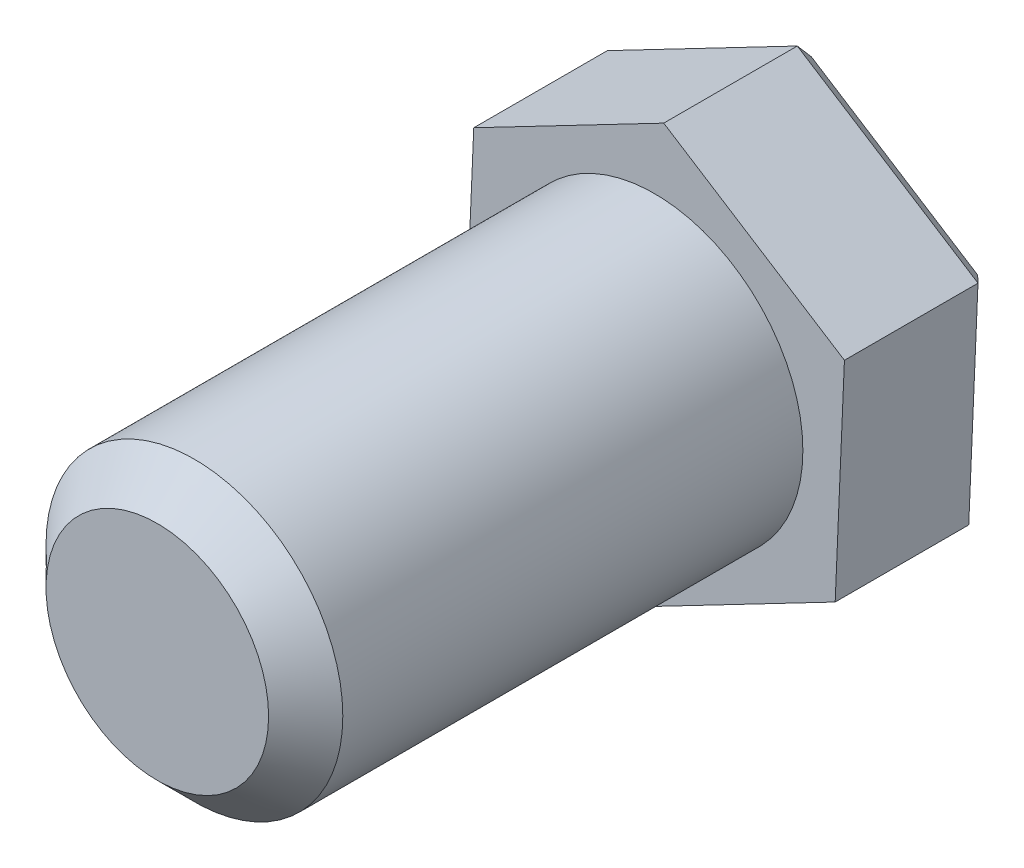
ISO-10303-21;
HEADER;
FILE_DESCRIPTION(('STEP AP214'),'2;1');
FILE_NAME('part.step','',(''),(''),'','','');
FILE_SCHEMA(('AUTOMOTIVE_DESIGN { 1 0 10303 214 1 1 1 1 }'));
ENDSEC;
DATA;
#1=APPLICATION_CONTEXT('core data for automotive mechanical design processes');
#2=APPLICATION_PROTOCOL_DEFINITION('international standard','automotive_design',2000,#1);
#3=PRODUCT_CONTEXT('',#1,'mechanical');
#4=PRODUCT('Part','Part','',(#3));
#5=PRODUCT_RELATED_PRODUCT_CATEGORY('part','',(#4));
#6=PRODUCT_DEFINITION_FORMATION('','',#4);
#7=PRODUCT_DEFINITION_CONTEXT('part definition',#1,'design');
#8=PRODUCT_DEFINITION('design','',#6,#7);
#9=PRODUCT_DEFINITION_SHAPE('','',#8);
#10=(LENGTH_UNIT() NAMED_UNIT(*) SI_UNIT(.MILLI.,.METRE.));
#11=(NAMED_UNIT(*) PLANE_ANGLE_UNIT() SI_UNIT($,.RADIAN.));
#12=(NAMED_UNIT(*) SI_UNIT($,.STERADIAN.) SOLID_ANGLE_UNIT());
#13=UNCERTAINTY_MEASURE_WITH_UNIT(LENGTH_MEASURE(1.E-05),#10,'distance_accuracy_value','');
#14=(GEOMETRIC_REPRESENTATION_CONTEXT(3) GLOBAL_UNCERTAINTY_ASSIGNED_CONTEXT((#13)) GLOBAL_UNIT_ASSIGNED_CONTEXT((#10,
#11,#12)) REPRESENTATION_CONTEXT('',''));
#15=CARTESIAN_POINT('',(0.,0.,0.));
#16=DIRECTION('',(0.,0.,1.));
#17=DIRECTION('',(1.,0.,0.));
#18=AXIS2_PLACEMENT_3D('',#15,#16,#17);
#19=CARTESIAN_POINT('',(0.,0.,6.7));
#20=DIRECTION('',(0.,0.,-1.));
#21=DIRECTION('',(-1.,0.,0.));
#22=AXIS2_PLACEMENT_3D('',#19,#20,#21);
#23=CYLINDRICAL_SURFACE('',#22,2.);
#24=CARTESIAN_POINT('',(0.,0.,6.2));
#25=DIRECTION('',(0.,0.,1.));
#26=DIRECTION('',(1.,0.,0.));
#27=AXIS2_PLACEMENT_3D('',#24,#25,#26);
#28=CIRCLE('',#27,2.);
#29=CARTESIAN_POINT('',(2.,0.,6.2));
#30=VERTEX_POINT('',#29);
#31=EDGE_CURVE('E184',#30,#30,#28,.F.);
#32=ORIENTED_EDGE('',*,*,#31,.T.);
#33=EDGE_LOOP('',(#32));
#34=FACE_BOUND('',#33,.T.);
#35=CARTESIAN_POINT('',(0.,0.,0.));
#36=DIRECTION('',(0.,0.,1.));
#37=DIRECTION('',(1.,0.,0.));
#38=AXIS2_PLACEMENT_3D('',#35,#36,#37);
#39=CIRCLE('',#38,2.);
#40=CARTESIAN_POINT('',(2.,0.,0.));
#41=VERTEX_POINT('',#40);
#42=EDGE_CURVE('E128',#41,#41,#39,.T.);
#43=ORIENTED_EDGE('',*,*,#42,.T.);
#44=EDGE_LOOP('',(#43));
#45=FACE_BOUND('',#44,.T.);
#46=ADVANCED_FACE('F47',(#34,#45),#23,.T.);
#47=CARTESIAN_POINT('',(0.,0.,6.7));
#48=DIRECTION('',(0.,0.,1.));
#49=DIRECTION('',(1.,0.,0.));
#50=AXIS2_PLACEMENT_3D('',#47,#48,#49);
#51=PLANE('',#50);
#52=CARTESIAN_POINT('',(0.,0.,6.7));
#53=DIRECTION('',(0.,0.,1.));
#54=DIRECTION('',(1.,0.,0.));
#55=AXIS2_PLACEMENT_3D('',#52,#53,#54);
#56=CIRCLE('',#55,1.5);
#57=CARTESIAN_POINT('',(1.5,0.,6.7));
#58=VERTEX_POINT('',#57);
#59=EDGE_CURVE('E180',#58,#58,#56,.T.);
#60=ORIENTED_EDGE('',*,*,#59,.T.);
#61=EDGE_LOOP('',(#60));
#62=FACE_BOUND('',#61,.T.);
#63=ADVANCED_FACE('F281',(#62),#51,.T.);
#64=CARTESIAN_POINT('',(0.,0.,6.7));
#65=DIRECTION('',(0.,0.,-1.));
#66=DIRECTION('',(-1.,0.,0.));
#67=AXIS2_PLACEMENT_3D('',#64,#65,#66);
#68=CONICAL_SURFACE('',#67,1.5,0.785398163397448);
#69=ORIENTED_EDGE('',*,*,#31,.F.);
#70=EDGE_LOOP('',(#69));
#71=FACE_BOUND('',#70,.T.);
#72=ORIENTED_EDGE('',*,*,#59,.F.);
#73=EDGE_LOOP('',(#72));
#74=FACE_BOUND('',#73,.T.);
#75=ADVANCED_FACE('F287',(#71,#74),#68,.T.);
#76=CARTESIAN_POINT('',(2.43525554792298,-1.55011733415367,-2.));
#77=DIRECTION('',(-0.462088466332157,0.886833834087759,0.));
#78=DIRECTION('',(-0.886833834087759,-0.462088466332157,0.));
#79=AXIS2_PLACEMENT_3D('',#76,#77,#78);
#80=PLANE('',#79);
#81=DIRECTION('',(0.,0.,1.));
#82=VECTOR('',#81,1.);
#83=CARTESIAN_POINT('',(-0.124813216262197,-2.88405183628513,-2.));
#84=LINE('',#83,#82);
#85=CARTESIAN_POINT('',(-0.124813216262197,-2.88405183628513,-1.8));
#86=VERTEX_POINT('',#85);
#87=CARTESIAN_POINT('',(-0.124813216262197,-2.88405183628513,0.));
#88=VERTEX_POINT('',#87);
#89=EDGE_CURVE('E119',#86,#88,#84,.T.);
#90=ORIENTED_EDGE('',*,*,#89,.F.);
#91=DIRECTION('',(0.886833834087759,0.462088466332157,0.));
#92=VECTOR('',#91,1.);
#93=CARTESIAN_POINT('',(2.43525554792298,-1.55011733415367,-1.8));
#94=LINE('',#93,#92);
#95=CARTESIAN_POINT('',(2.43525554792298,-1.55011733415367,-1.8));
#96=VERTEX_POINT('',#95);
#97=EDGE_CURVE('E11',#86,#96,#94,.T.);
#98=ORIENTED_EDGE('',*,*,#97,.T.);
#99=DIRECTION('',(0.,0.,1.));
#100=VECTOR('',#99,1.);
#101=CARTESIAN_POINT('',(2.43525554792298,-1.55011733415367,-2.));
#102=LINE('',#101,#100);
#103=CARTESIAN_POINT('',(2.43525554792298,-1.55011733415367,0.));
#104=VERTEX_POINT('',#103);
#105=EDGE_CURVE('E143',#96,#104,#102,.T.);
#106=ORIENTED_EDGE('',*,*,#105,.T.);
#107=DIRECTION('',(-0.886833834087759,-0.462088466332157,0.));
#108=VECTOR('',#107,1.);
#109=CARTESIAN_POINT('',(2.43525554792298,-1.55011733415367,0.));
#110=LINE('',#109,#108);
#111=EDGE_CURVE('E135',#104,#88,#110,.T.);
#112=ORIENTED_EDGE('',*,*,#111,.T.);
#113=EDGE_LOOP('',(#90,#98,#106,#112));
#114=FACE_BOUND('',#113,.T.);
#115=ADVANCED_FACE('F141',(#114),#80,.F.);
#116=CARTESIAN_POINT('',(-0.124813216262197,-2.88405183628513,-2.));
#117=DIRECTION('',(0.536976396089475,0.843597267683317,0.));
#118=DIRECTION('',(-0.843597267683317,0.536976396089475,0.));
#119=AXIS2_PLACEMENT_3D('',#116,#117,#118);
#120=PLANE('',#119);
#121=DIRECTION('',(0.,0.,1.));
#122=VECTOR('',#121,1.);
#123=CARTESIAN_POINT('',(-2.56006876418518,-1.33393450213146,-2.));
#124=LINE('',#123,#122);
#125=CARTESIAN_POINT('',(-2.56006876418518,-1.33393450213146,-1.8));
#126=VERTEX_POINT('',#125);
#127=CARTESIAN_POINT('',(-2.56006876418518,-1.33393450213146,0.));
#128=VERTEX_POINT('',#127);
#129=EDGE_CURVE('E129',#126,#128,#124,.T.);
#130=ORIENTED_EDGE('',*,*,#129,.F.);
#131=DIRECTION('',(0.843597267683317,-0.536976396089475,0.));
#132=VECTOR('',#131,1.);
#133=CARTESIAN_POINT('',(-0.124813216262197,-2.88405183628513,-1.8));
#134=LINE('',#133,#132);
#135=EDGE_CURVE('E58',#126,#86,#134,.T.);
#136=ORIENTED_EDGE('',*,*,#135,.T.);
#137=ORIENTED_EDGE('',*,*,#89,.T.);
#138=DIRECTION('',(-0.843597267683317,0.536976396089475,0.));
#139=VECTOR('',#138,1.);
#140=CARTESIAN_POINT('',(-0.124813216262197,-2.88405183628513,0.));
#141=LINE('',#140,#139);
#142=EDGE_CURVE('E122',#88,#128,#141,.T.);
#143=ORIENTED_EDGE('',*,*,#142,.T.);
#144=EDGE_LOOP('',(#130,#136,#137,#143));
#145=FACE_BOUND('',#144,.T.);
#146=ADVANCED_FACE('F121',(#145),#120,.F.);
#147=CARTESIAN_POINT('',(-2.56006876418518,-1.33393450213146,-2.));
#148=DIRECTION('',(0.999064862421632,-0.0432365664044416,0.));
#149=DIRECTION('',(0.0432365664044416,0.999064862421632,0.));
#150=AXIS2_PLACEMENT_3D('',#147,#148,#149);
#151=PLANE('',#150);
#152=DIRECTION('',(0.,0.,1.));
#153=VECTOR('',#152,1.);
#154=CARTESIAN_POINT('',(-2.43525554792298,1.55011733415367,-2.));
#155=LINE('',#154,#153);
#156=CARTESIAN_POINT('',(-2.43525554792298,1.55011733415367,-1.8));
#157=VERTEX_POINT('',#156);
#158=CARTESIAN_POINT('',(-2.43525554792298,1.55011733415367,0.));
#159=VERTEX_POINT('',#158);
#160=EDGE_CURVE('E172',#157,#159,#155,.T.);
#161=ORIENTED_EDGE('',*,*,#160,.F.);
#162=DIRECTION('',(-0.0432365664044416,-0.999064862421632,0.));
#163=VECTOR('',#162,1.);
#164=CARTESIAN_POINT('',(-2.56006876418518,-1.33393450213146,-1.8));
#165=LINE('',#164,#163);
#166=EDGE_CURVE('E73',#157,#126,#165,.T.);
#167=ORIENTED_EDGE('',*,*,#166,.T.);
#168=ORIENTED_EDGE('',*,*,#129,.T.);
#169=DIRECTION('',(0.0432365664044416,0.999064862421632,0.));
#170=VECTOR('',#169,1.);
#171=CARTESIAN_POINT('',(-2.56006876418518,-1.33393450213146,0.));
#172=LINE('',#171,#170);
#173=EDGE_CURVE('E138',#128,#159,#172,.T.);
#174=ORIENTED_EDGE('',*,*,#173,.T.);
#175=EDGE_LOOP('',(#161,#167,#168,#174));
#176=FACE_BOUND('',#175,.T.);
#177=ADVANCED_FACE('F411',(#176),#151,.F.);
#178=CARTESIAN_POINT('',(-2.43525554792298,1.55011733415367,-2.));
#179=DIRECTION('',(0.462088466332157,-0.886833834087759,0.));
#180=DIRECTION('',(0.886833834087759,0.462088466332157,0.));
#181=AXIS2_PLACEMENT_3D('',#178,#179,#180);
#182=PLANE('',#181);
#183=DIRECTION('',(0.,0.,1.));
#184=VECTOR('',#183,1.);
#185=CARTESIAN_POINT('',(0.124813216262197,2.88405183628513,-2.));
#186=LINE('',#185,#184);
#187=CARTESIAN_POINT('',(0.124813216262197,2.88405183628513,-1.8));
#188=VERTEX_POINT('',#187);
#189=CARTESIAN_POINT('',(0.124813216262197,2.88405183628513,0.));
#190=VERTEX_POINT('',#189);
#191=EDGE_CURVE('E169',#188,#190,#186,.T.);
#192=ORIENTED_EDGE('',*,*,#191,.F.);
#193=DIRECTION('',(-0.886833834087759,-0.462088466332157,0.));
#194=VECTOR('',#193,1.);
#195=CARTESIAN_POINT('',(-2.43525554792298,1.55011733415367,-1.8));
#196=LINE('',#195,#194);
#197=EDGE_CURVE('E214',#188,#157,#196,.T.);
#198=ORIENTED_EDGE('',*,*,#197,.T.);
#199=ORIENTED_EDGE('',*,*,#160,.T.);
#200=DIRECTION('',(0.886833834087759,0.462088466332157,0.));
#201=VECTOR('',#200,1.);
#202=CARTESIAN_POINT('',(-2.43525554792298,1.55011733415367,0.));
#203=LINE('',#202,#201);
#204=EDGE_CURVE('E153',#159,#190,#203,.T.);
#205=ORIENTED_EDGE('',*,*,#204,.T.);
#206=EDGE_LOOP('',(#192,#198,#199,#205));
#207=FACE_BOUND('',#206,.T.);
#208=ADVANCED_FACE('F269',(#207),#182,.F.);
#209=CARTESIAN_POINT('',(0.124813216262197,2.88405183628513,-2.));
#210=DIRECTION('',(-0.536976396089475,-0.843597267683318,0.));
#211=DIRECTION('',(0.843597267683318,-0.536976396089475,0.));
#212=AXIS2_PLACEMENT_3D('',#209,#210,#211);
#213=PLANE('',#212);
#214=DIRECTION('',(0.,0.,1.));
#215=VECTOR('',#214,1.);
#216=CARTESIAN_POINT('',(2.56006876418518,1.33393450213146,-2.));
#217=LINE('',#216,#215);
#218=CARTESIAN_POINT('',(2.56006876418518,1.33393450213146,-1.8));
#219=VERTEX_POINT('',#218);
#220=CARTESIAN_POINT('',(2.56006876418518,1.33393450213146,0.));
#221=VERTEX_POINT('',#220);
#222=EDGE_CURVE('E166',#219,#221,#217,.T.);
#223=ORIENTED_EDGE('',*,*,#222,.F.);
#224=DIRECTION('',(-0.843597267683318,0.536976396089475,0.));
#225=VECTOR('',#224,1.);
#226=CARTESIAN_POINT('',(0.124813216262197,2.88405183628513,-1.8));
#227=LINE('',#226,#225);
#228=EDGE_CURVE('E211',#219,#188,#227,.T.);
#229=ORIENTED_EDGE('',*,*,#228,.T.);
#230=ORIENTED_EDGE('',*,*,#191,.T.);
#231=DIRECTION('',(0.843597267683318,-0.536976396089475,0.));
#232=VECTOR('',#231,1.);
#233=CARTESIAN_POINT('',(0.124813216262197,2.88405183628513,0.));
#234=LINE('',#233,#232);
#235=EDGE_CURVE('E157',#190,#221,#234,.T.);
#236=ORIENTED_EDGE('',*,*,#235,.T.);
#237=EDGE_LOOP('',(#223,#229,#230,#236));
#238=FACE_BOUND('',#237,.T.);
#239=ADVANCED_FACE('F266',(#238),#213,.F.);
#240=CARTESIAN_POINT('',(2.56006876418518,1.33393450213146,-2.));
#241=DIRECTION('',(-0.999064862421632,0.0432365664044415,0.));
#242=DIRECTION('',(-0.0432365664044415,-0.999064862421632,0.));
#243=AXIS2_PLACEMENT_3D('',#240,#241,#242);
#244=PLANE('',#243);
#245=ORIENTED_EDGE('',*,*,#105,.F.);
#246=DIRECTION('',(0.0432365664044415,0.999064862421632,0.));
#247=VECTOR('',#246,1.);
#248=CARTESIAN_POINT('',(2.56006876418518,1.33393450213146,-1.8));
#249=LINE('',#248,#247);
#250=EDGE_CURVE('E207',#96,#219,#249,.T.);
#251=ORIENTED_EDGE('',*,*,#250,.T.);
#252=ORIENTED_EDGE('',*,*,#222,.T.);
#253=DIRECTION('',(-0.0432365664044415,-0.999064862421632,0.));
#254=VECTOR('',#253,1.);
#255=CARTESIAN_POINT('',(2.56006876418518,1.33393450213146,0.));
#256=LINE('',#255,#254);
#257=EDGE_CURVE('E161',#221,#104,#256,.T.);
#258=ORIENTED_EDGE('',*,*,#257,.T.);
#259=EDGE_LOOP('',(#245,#251,#252,#258));
#260=FACE_BOUND('',#259,.T.);
#261=ADVANCED_FACE('F255',(#260),#244,.F.);
#262=CARTESIAN_POINT('',(0.,0.,-2.));
#263=DIRECTION('',(0.,0.,-1.));
#264=DIRECTION('',(-1.,0.,0.));
#265=AXIS2_PLACEMENT_3D('',#262,#263,#264);
#266=PLANE('',#265);
#267=DIRECTION('',(0.843597267683318,-0.536976396089475,0.));
#268=VECTOR('',#267,1.);
#269=CARTESIAN_POINT('',(2.45267348496728,1.1652150485948,-2.));
#270=LINE('',#269,#268);
#271=CARTESIAN_POINT('',(0.11482815896122,2.65332768938232,-2.));
#272=VERTEX_POINT('',#271);
#273=CARTESIAN_POINT('',(2.35526326305036,1.22721974196094,-2.));
#274=VERTEX_POINT('',#273);
#275=EDGE_CURVE('E200',#272,#274,#270,.T.);
#276=ORIENTED_EDGE('',*,*,#275,.T.);
#277=DIRECTION('',(-0.0432365664044415,-0.999064862421632,0.));
#278=VECTOR('',#277,1.);
#279=CARTESIAN_POINT('',(2.23544257543865,-1.54147002087278,-2.));
#280=LINE('',#279,#278);
#281=CARTESIAN_POINT('',(2.24043510408914,-1.42610794742137,-2.));
#282=VERTEX_POINT('',#281);
#283=EDGE_CURVE('E203',#274,#282,#280,.T.);
#284=ORIENTED_EDGE('',*,*,#283,.T.);
#285=DIRECTION('',(-0.886833834087759,-0.462088466332157,0.));
#286=VECTOR('',#285,1.);
#287=CARTESIAN_POINT('',(-0.21723090952863,-2.70668506946757,-2.));
#288=LINE('',#287,#286);
#289=CARTESIAN_POINT('',(-0.114828158961222,-2.65332768938232,-2.));
#290=VERTEX_POINT('',#289);
#291=EDGE_CURVE('E188',#282,#290,#288,.T.);
#292=ORIENTED_EDGE('',*,*,#291,.T.);
#293=DIRECTION('',(-0.843597267683317,0.536976396089476,0.));
#294=VECTOR('',#293,1.);
#295=CARTESIAN_POINT('',(-2.45267348496728,-1.16521504859479,-2.));
#296=LINE('',#295,#294);
#297=CARTESIAN_POINT('',(-2.35526326305036,-1.22721974196094,-2.));
#298=VERTEX_POINT('',#297);
#299=EDGE_CURVE('E191',#290,#298,#296,.T.);
#300=ORIENTED_EDGE('',*,*,#299,.T.);
#301=DIRECTION('',(0.0432365664044416,0.999064862421632,0.));
#302=VECTOR('',#301,1.);
#303=CARTESIAN_POINT('',(-2.23544257543865,1.54147002087278,-2.));
#304=LINE('',#303,#302);
#305=CARTESIAN_POINT('',(-2.24043510408914,1.42610794742137,-2.));
#306=VERTEX_POINT('',#305);
#307=EDGE_CURVE('E194',#298,#306,#304,.T.);
#308=ORIENTED_EDGE('',*,*,#307,.T.);
#309=DIRECTION('',(0.886833834087759,0.462088466332157,0.));
#310=VECTOR('',#309,1.);
#311=CARTESIAN_POINT('',(0.217230909528629,2.70668506946758,-2.));
#312=LINE('',#311,#310);
#313=EDGE_CURVE('E197',#306,#272,#312,.T.);
#314=ORIENTED_EDGE('',*,*,#313,.T.);
#315=EDGE_LOOP('',(#276,#284,#292,#300,#308,#314));
#316=FACE_BOUND('',#315,.T.);
#317=ADVANCED_FACE('F245',(#316),#266,.T.);
#318=CARTESIAN_POINT('',(0.,0.,0.));
#319=DIRECTION('',(0.,0.,-1.));
#320=DIRECTION('',(-1.,0.,0.));
#321=AXIS2_PLACEMENT_3D('',#318,#319,#320);
#322=PLANE('',#321);
#323=ORIENTED_EDGE('',*,*,#42,.F.);
#324=EDGE_LOOP('',(#323));
#325=FACE_BOUND('',#324,.T.);
#326=ORIENTED_EDGE('',*,*,#111,.F.);
#327=ORIENTED_EDGE('',*,*,#257,.F.);
#328=ORIENTED_EDGE('',*,*,#235,.F.);
#329=ORIENTED_EDGE('',*,*,#204,.F.);
#330=ORIENTED_EDGE('',*,*,#173,.F.);
#331=ORIENTED_EDGE('',*,*,#142,.F.);
#332=EDGE_LOOP('',(#326,#327,#328,#329,#330,#331));
#333=FACE_BOUND('',#332,.T.);
#334=ADVANCED_FACE('F133',(#325,#333),#322,.F.);
#335=CARTESIAN_POINT('',(-2.29784918356975,0.0994441027302156,-2.));
#336=DIRECTION('',(-0.706445539063541,0.0305728692998031,-0.707106781186548));
#337=DIRECTION('',(-0.0432365664044416,-0.999064862421632,0.));
#338=AXIS2_PLACEMENT_3D('',#335,#336,#337);
#339=PLANE('',#338);
#340=DIRECTION('',(0.670383365495465,0.349306047321751,-0.654653670707977));
#341=VECTOR('',#340,1.);
#342=CARTESIAN_POINT('',(-2.01879708261459,-1.05190263596652,-2.32857142857143));
#343=LINE('',#342,#341);
#344=EDGE_CURVE('E149',#126,#298,#343,.T.);
#345=ORIENTED_EDGE('',*,*,#344,.F.);
#346=ORIENTED_EDGE('',*,*,#166,.F.);
#347=DIRECTION('',(0.637699593423899,-0.405916001132704,-0.654653670707977));
#348=VECTOR('',#347,1.);
#349=CARTESIAN_POINT('',(-1.92037294636212,1.22237824064689,-2.32857142857143));
#350=LINE('',#349,#348);
#351=EDGE_CURVE('E52',#306,#157,#350,.F.);
#352=ORIENTED_EDGE('',*,*,#351,.F.);
#353=ORIENTED_EDGE('',*,*,#307,.F.);
#354=EDGE_LOOP('',(#345,#346,#352,#353));
#355=FACE_BOUND('',#354,.T.);
#356=ADVANCED_FACE('F50',(#355),#339,.T.);
#357=CARTESIAN_POINT('',(-1.06280347256396,2.03971781840184,-2.));
#358=DIRECTION('',(-0.32674588805156,0.62708621786912,-0.707106781186547));
#359=DIRECTION('',(-0.886833834087759,-0.462088466332157,0.));
#360=AXIS2_PLACEMENT_3D('',#357,#358,#359);
#361=PLANE('',#360);
#362=ORIENTED_EDGE('',*,*,#351,.T.);
#363=ORIENTED_EDGE('',*,*,#197,.F.);
#364=DIRECTION('',(-0.0326837720715661,-0.755222048454456,-0.654653670707978));
#365=VECTOR('',#364,1.);
#366=CARTESIAN_POINT('',(0.0984241362524752,2.27428087661341,-2.32857142857143));
#367=LINE('',#366,#365);
#368=EDGE_CURVE('E231',#272,#188,#367,.F.);
#369=ORIENTED_EDGE('',*,*,#368,.F.);
#370=ORIENTED_EDGE('',*,*,#313,.F.);
#371=EDGE_LOOP('',(#362,#363,#369,#370));
#372=FACE_BOUND('',#371,.T.);
#373=ADVANCED_FACE('F272',(#372),#361,.T.);
#374=CARTESIAN_POINT('',(-1.23504571100579,-1.94027371567163,-2.));
#375=DIRECTION('',(-0.379699651011982,-0.596513348569317,-0.707106781186547));
#376=DIRECTION('',(0.843597267683317,-0.536976396089475,0.));
#377=AXIS2_PLACEMENT_3D('',#374,#375,#376);
#378=PLANE('',#377);
#379=ORIENTED_EDGE('',*,*,#344,.T.);
#380=ORIENTED_EDGE('',*,*,#299,.F.);
#381=DIRECTION('',(0.0326837720715654,0.755222048454457,-0.654653670707977));
#382=VECTOR('',#381,1.);
#383=CARTESIAN_POINT('',(-0.098424136252476,-2.27428087661341,-2.32857142857143));
#384=LINE('',#383,#382);
#385=EDGE_CURVE('E227',#86,#290,#384,.T.);
#386=ORIENTED_EDGE('',*,*,#385,.F.);
#387=ORIENTED_EDGE('',*,*,#135,.F.);
#388=EDGE_LOOP('',(#379,#380,#386,#387));
#389=FACE_BOUND('',#388,.T.);
#390=ADVANCED_FACE('F239',(#389),#378,.T.);
#391=CARTESIAN_POINT('',(1.23504571100579,1.94027371567163,-2.));
#392=DIRECTION('',(0.379699651011982,0.596513348569317,-0.707106781186547));
#393=DIRECTION('',(-0.843597267683318,0.536976396089475,0.));
#394=AXIS2_PLACEMENT_3D('',#391,#392,#393);
#395=PLANE('',#394);
#396=ORIENTED_EDGE('',*,*,#368,.T.);
#397=ORIENTED_EDGE('',*,*,#228,.F.);
#398=DIRECTION('',(-0.670383365495464,-0.349306047321751,-0.654653670707978));
#399=VECTOR('',#398,1.);
#400=CARTESIAN_POINT('',(2.0187970826146,1.05190263596652,-2.32857142857143));
#401=LINE('',#400,#399);
#402=EDGE_CURVE('E224',#274,#219,#401,.F.);
#403=ORIENTED_EDGE('',*,*,#402,.F.);
#404=ORIENTED_EDGE('',*,*,#275,.F.);
#405=EDGE_LOOP('',(#396,#397,#403,#404));
#406=FACE_BOUND('',#405,.T.);
#407=ADVANCED_FACE('F263',(#406),#395,.T.);
#408=CARTESIAN_POINT('',(1.06280347256396,-2.03971781840184,-2.));
#409=DIRECTION('',(0.32674588805156,-0.62708621786912,-0.707106781186548));
#410=DIRECTION('',(0.886833834087759,0.462088466332157,0.));
#411=AXIS2_PLACEMENT_3D('',#408,#409,#410);
#412=PLANE('',#411);
#413=ORIENTED_EDGE('',*,*,#385,.T.);
#414=ORIENTED_EDGE('',*,*,#291,.F.);
#415=DIRECTION('',(0.637699593423898,-0.405916001132706,0.654653670707977));
#416=VECTOR('',#415,1.);
#417=CARTESIAN_POINT('',(1.92037294636212,-1.22237824064689,-2.32857142857143));
#418=LINE('',#417,#416);
#419=EDGE_CURVE('E221',#96,#282,#418,.F.);
#420=ORIENTED_EDGE('',*,*,#419,.F.);
#421=ORIENTED_EDGE('',*,*,#97,.F.);
#422=EDGE_LOOP('',(#413,#414,#420,#421));
#423=FACE_BOUND('',#422,.T.);
#424=ADVANCED_FACE('F251',(#423),#412,.T.);
#425=CARTESIAN_POINT('',(2.29784918356975,-0.0994441027302153,-2.));
#426=DIRECTION('',(0.706445539063541,-0.030572869299803,-0.707106781186547));
#427=DIRECTION('',(0.0432365664044415,0.999064862421632,0.));
#428=AXIS2_PLACEMENT_3D('',#425,#426,#427);
#429=PLANE('',#428);
#430=ORIENTED_EDGE('',*,*,#402,.T.);
#431=ORIENTED_EDGE('',*,*,#250,.F.);
#432=ORIENTED_EDGE('',*,*,#419,.T.);
#433=ORIENTED_EDGE('',*,*,#283,.F.);
#434=EDGE_LOOP('',(#430,#431,#432,#433));
#435=FACE_BOUND('',#434,.T.);
#436=ADVANCED_FACE('F258',(#435),#429,.T.);
#437=CLOSED_SHELL('',(#46,#63,#75,#115,#146,#177,#208,#239,#261,#317,#334,#356,#373,#390,#407,
#424,#436));
#438=MANIFOLD_SOLID_BREP('B2',#437);
#439=ADVANCED_BREP_SHAPE_REPRESENTATION('',(#18,#438),#14);
#440=SHAPE_DEFINITION_REPRESENTATION(#9,#439);
ENDSEC;
END-ISO-10303-21;
